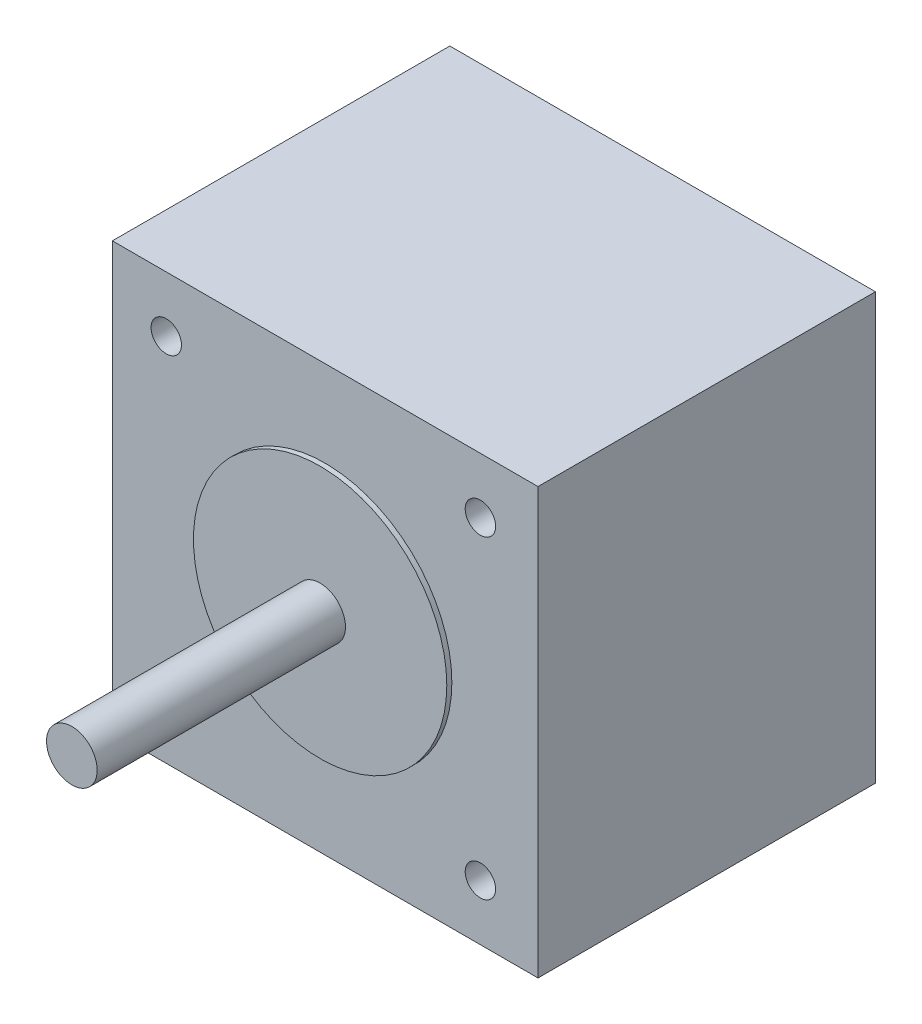
ISO-10303-21;
HEADER;
FILE_DESCRIPTION(('STEP AP214'),'2;1');
FILE_NAME('part.step','',(''),(''),'','','');
FILE_SCHEMA(('AUTOMOTIVE_DESIGN { 1 0 10303 214 1 1 1 1 }'));
ENDSEC;
DATA;
#1=APPLICATION_CONTEXT('core data for automotive mechanical design processes');
#2=APPLICATION_PROTOCOL_DEFINITION('international standard','automotive_design',2000,#1);
#3=PRODUCT_CONTEXT('',#1,'mechanical');
#4=PRODUCT('Part','Part','',(#3));
#5=PRODUCT_RELATED_PRODUCT_CATEGORY('part','',(#4));
#6=PRODUCT_DEFINITION_FORMATION('','',#4);
#7=PRODUCT_DEFINITION_CONTEXT('part definition',#1,'design');
#8=PRODUCT_DEFINITION('design','',#6,#7);
#9=PRODUCT_DEFINITION_SHAPE('','',#8);
#10=(LENGTH_UNIT() NAMED_UNIT(*) SI_UNIT(.MILLI.,.METRE.));
#11=(NAMED_UNIT(*) PLANE_ANGLE_UNIT() SI_UNIT($,.RADIAN.));
#12=(NAMED_UNIT(*) SI_UNIT($,.STERADIAN.) SOLID_ANGLE_UNIT());
#13=UNCERTAINTY_MEASURE_WITH_UNIT(LENGTH_MEASURE(1.E-05),#10,'distance_accuracy_value','');
#14=(GEOMETRIC_REPRESENTATION_CONTEXT(3) GLOBAL_UNCERTAINTY_ASSIGNED_CONTEXT((#13)) GLOBAL_UNIT_ASSIGNED_CONTEXT((#10,
#11,#12)) REPRESENTATION_CONTEXT('',''));
#15=CARTESIAN_POINT('',(0.,0.,0.));
#16=DIRECTION('',(0.,0.,1.));
#17=DIRECTION('',(1.,0.,0.));
#18=AXIS2_PLACEMENT_3D('',#15,#16,#17);
#19=CARTESIAN_POINT('',(-21.,-21.,33.3));
#20=DIRECTION('',(1.,0.,0.));
#21=DIRECTION('',(0.,0.,-1.));
#22=AXIS2_PLACEMENT_3D('',#19,#20,#21);
#23=PLANE('',#22);
#24=DIRECTION('',(0.,-1.,0.));
#25=VECTOR('',#24,1.);
#26=CARTESIAN_POINT('',(-21.,-21.,0.));
#27=LINE('',#26,#25);
#28=CARTESIAN_POINT('',(-21.,21.,0.));
#29=VERTEX_POINT('',#28);
#30=CARTESIAN_POINT('',(-21.,-21.,0.));
#31=VERTEX_POINT('',#30);
#32=EDGE_CURVE('E100',#29,#31,#27,.T.);
#33=ORIENTED_EDGE('',*,*,#32,.T.);
#34=DIRECTION('',(0.,0.,-1.));
#35=VECTOR('',#34,1.);
#36=CARTESIAN_POINT('',(-21.,-21.,33.3));
#37=LINE('',#36,#35);
#38=CARTESIAN_POINT('',(-21.,-21.,33.3));
#39=VERTEX_POINT('',#38);
#40=EDGE_CURVE('E11',#39,#31,#37,.T.);
#41=ORIENTED_EDGE('',*,*,#40,.F.);
#42=DIRECTION('',(0.,-1.,0.));
#43=VECTOR('',#42,1.);
#44=CARTESIAN_POINT('',(-21.,-21.,33.3));
#45=LINE('',#44,#43);
#46=CARTESIAN_POINT('',(-21.,21.,33.3));
#47=VERTEX_POINT('',#46);
#48=EDGE_CURVE('E87',#47,#39,#45,.T.);
#49=ORIENTED_EDGE('',*,*,#48,.F.);
#50=DIRECTION('',(0.,0.,-1.));
#51=VECTOR('',#50,1.);
#52=CARTESIAN_POINT('',(-21.,21.,33.3));
#53=LINE('',#52,#51);
#54=EDGE_CURVE('E96',#47,#29,#53,.T.);
#55=ORIENTED_EDGE('',*,*,#54,.T.);
#56=EDGE_LOOP('',(#33,#41,#49,#55));
#57=FACE_BOUND('',#56,.T.);
#58=ADVANCED_FACE('F35',(#57),#23,.F.);
#59=CARTESIAN_POINT('',(21.,-21.,33.3));
#60=DIRECTION('',(0.,1.,0.));
#61=DIRECTION('',(-1.,0.,0.));
#62=AXIS2_PLACEMENT_3D('',#59,#60,#61);
#63=PLANE('',#62);
#64=DIRECTION('',(1.,0.,0.));
#65=VECTOR('',#64,1.);
#66=CARTESIAN_POINT('',(21.,-21.,0.));
#67=LINE('',#66,#65);
#68=CARTESIAN_POINT('',(21.,-21.,0.));
#69=VERTEX_POINT('',#68);
#70=EDGE_CURVE('E91',#31,#69,#67,.T.);
#71=ORIENTED_EDGE('',*,*,#70,.T.);
#72=DIRECTION('',(0.,0.,-1.));
#73=VECTOR('',#72,1.);
#74=CARTESIAN_POINT('',(21.,-21.,33.3));
#75=LINE('',#74,#73);
#76=CARTESIAN_POINT('',(21.,-21.,33.3));
#77=VERTEX_POINT('',#76);
#78=EDGE_CURVE('E44',#77,#69,#75,.T.);
#79=ORIENTED_EDGE('',*,*,#78,.F.);
#80=DIRECTION('',(1.,0.,0.));
#81=VECTOR('',#80,1.);
#82=CARTESIAN_POINT('',(21.,-21.,33.3));
#83=LINE('',#82,#81);
#84=EDGE_CURVE('E82',#39,#77,#83,.T.);
#85=ORIENTED_EDGE('',*,*,#84,.F.);
#86=ORIENTED_EDGE('',*,*,#40,.T.);
#87=EDGE_LOOP('',(#71,#79,#85,#86));
#88=FACE_BOUND('',#87,.T.);
#89=ADVANCED_FACE('F90',(#88),#63,.F.);
#90=CARTESIAN_POINT('',(21.,-21.,33.3));
#91=DIRECTION('',(-1.,0.,0.));
#92=DIRECTION('',(0.,0.,1.));
#93=AXIS2_PLACEMENT_3D('',#90,#91,#92);
#94=PLANE('',#93);
#95=DIRECTION('',(0.,1.,0.));
#96=VECTOR('',#95,1.);
#97=CARTESIAN_POINT('',(21.,-21.,0.));
#98=LINE('',#97,#96);
#99=CARTESIAN_POINT('',(21.,21.,0.));
#100=VERTEX_POINT('',#99);
#101=EDGE_CURVE('E69',#69,#100,#98,.T.);
#102=ORIENTED_EDGE('',*,*,#101,.T.);
#103=DIRECTION('',(0.,0.,-1.));
#104=VECTOR('',#103,1.);
#105=CARTESIAN_POINT('',(21.,21.,33.3));
#106=LINE('',#105,#104);
#107=CARTESIAN_POINT('',(21.,21.,33.3));
#108=VERTEX_POINT('',#107);
#109=EDGE_CURVE('E92',#108,#100,#106,.T.);
#110=ORIENTED_EDGE('',*,*,#109,.F.);
#111=DIRECTION('',(0.,1.,0.));
#112=VECTOR('',#111,1.);
#113=CARTESIAN_POINT('',(21.,-21.,33.3));
#114=LINE('',#113,#112);
#115=EDGE_CURVE('E85',#77,#108,#114,.T.);
#116=ORIENTED_EDGE('',*,*,#115,.F.);
#117=ORIENTED_EDGE('',*,*,#78,.T.);
#118=EDGE_LOOP('',(#102,#110,#116,#117));
#119=FACE_BOUND('',#118,.T.);
#120=ADVANCED_FACE('F94',(#119),#94,.F.);
#121=CARTESIAN_POINT('',(21.,21.,33.3));
#122=DIRECTION('',(0.,-1.,0.));
#123=DIRECTION('',(1.,0.,0.));
#124=AXIS2_PLACEMENT_3D('',#121,#122,#123);
#125=PLANE('',#124);
#126=DIRECTION('',(-1.,0.,0.));
#127=VECTOR('',#126,1.);
#128=CARTESIAN_POINT('',(21.,21.,0.));
#129=LINE('',#128,#127);
#130=EDGE_CURVE('E75',#100,#29,#129,.T.);
#131=ORIENTED_EDGE('',*,*,#130,.T.);
#132=ORIENTED_EDGE('',*,*,#54,.F.);
#133=DIRECTION('',(-1.,0.,0.));
#134=VECTOR('',#133,1.);
#135=CARTESIAN_POINT('',(21.,21.,33.3));
#136=LINE('',#135,#134);
#137=EDGE_CURVE('E52',#108,#47,#136,.T.);
#138=ORIENTED_EDGE('',*,*,#137,.F.);
#139=ORIENTED_EDGE('',*,*,#109,.T.);
#140=EDGE_LOOP('',(#131,#132,#138,#139));
#141=FACE_BOUND('',#140,.T.);
#142=ADVANCED_FACE('F108',(#141),#125,.F.);
#143=CARTESIAN_POINT('',(0.,0.,33.3));
#144=DIRECTION('',(0.,0.,1.));
#145=DIRECTION('',(1.,0.,0.));
#146=AXIS2_PLACEMENT_3D('',#143,#144,#145);
#147=PLANE('',#146);
#148=CARTESIAN_POINT('',(15.3174614589269,15.5,33.3));
#149=DIRECTION('',(0.,0.,1.));
#150=DIRECTION('',(1.,0.,0.));
#151=AXIS2_PLACEMENT_3D('',#148,#149,#150);
#152=CIRCLE('',#151,1.5);
#153=CARTESIAN_POINT('',(16.8174614589269,15.5,33.3));
#154=VERTEX_POINT('',#153);
#155=EDGE_CURVE('E138',#154,#154,#152,.T.);
#156=ORIENTED_EDGE('',*,*,#155,.F.);
#157=EDGE_LOOP('',(#156));
#158=FACE_BOUND('',#157,.T.);
#159=CARTESIAN_POINT('',(-15.6825385410731,-15.5,33.3));
#160=DIRECTION('',(0.,0.,1.));
#161=DIRECTION('',(1.,0.,0.));
#162=AXIS2_PLACEMENT_3D('',#159,#160,#161);
#163=CIRCLE('',#162,1.5);
#164=CARTESIAN_POINT('',(-14.1825385410731,-15.5,33.3));
#165=VERTEX_POINT('',#164);
#166=EDGE_CURVE('E132',#165,#165,#163,.T.);
#167=ORIENTED_EDGE('',*,*,#166,.F.);
#168=EDGE_LOOP('',(#167));
#169=FACE_BOUND('',#168,.T.);
#170=CARTESIAN_POINT('',(15.3174614589269,-15.5,33.3));
#171=DIRECTION('',(0.,0.,1.));
#172=DIRECTION('',(1.,0.,0.));
#173=AXIS2_PLACEMENT_3D('',#170,#171,#172);
#174=CIRCLE('',#173,1.5);
#175=CARTESIAN_POINT('',(16.8174614589269,-15.5,33.3));
#176=VERTEX_POINT('',#175);
#177=EDGE_CURVE('E126',#176,#176,#174,.T.);
#178=ORIENTED_EDGE('',*,*,#177,.F.);
#179=EDGE_LOOP('',(#178));
#180=FACE_BOUND('',#179,.T.);
#181=CARTESIAN_POINT('',(-15.6825385410731,15.5,33.3));
#182=DIRECTION('',(0.,0.,1.));
#183=DIRECTION('',(1.,0.,0.));
#184=AXIS2_PLACEMENT_3D('',#181,#182,#183);
#185=CIRCLE('',#184,1.5);
#186=CARTESIAN_POINT('',(-14.1825385410731,15.5,33.3));
#187=VERTEX_POINT('',#186);
#188=EDGE_CURVE('E120',#187,#187,#185,.T.);
#189=ORIENTED_EDGE('',*,*,#188,.F.);
#190=EDGE_LOOP('',(#189));
#191=FACE_BOUND('',#190,.T.);
#192=CARTESIAN_POINT('',(0.,0.,33.3));
#193=DIRECTION('',(0.,0.,1.));
#194=DIRECTION('',(1.,0.,0.));
#195=AXIS2_PLACEMENT_3D('',#192,#193,#194);
#196=CIRCLE('',#195,12.5);
#197=CARTESIAN_POINT('',(12.5,0.,33.3));
#198=VERTEX_POINT('',#197);
#199=EDGE_CURVE('E114',#198,#198,#196,.T.);
#200=ORIENTED_EDGE('',*,*,#199,.F.);
#201=EDGE_LOOP('',(#200));
#202=FACE_BOUND('',#201,.T.);
#203=ORIENTED_EDGE('',*,*,#48,.T.);
#204=ORIENTED_EDGE('',*,*,#84,.T.);
#205=ORIENTED_EDGE('',*,*,#115,.T.);
#206=ORIENTED_EDGE('',*,*,#137,.T.);
#207=EDGE_LOOP('',(#203,#204,#205,#206));
#208=FACE_BOUND('',#207,.T.);
#209=ADVANCED_FACE('F83',(#158,#169,#180,#191,#202,#208),#147,.T.);
#210=CARTESIAN_POINT('',(0.,0.,0.));
#211=DIRECTION('',(0.,0.,1.));
#212=DIRECTION('',(1.,0.,0.));
#213=AXIS2_PLACEMENT_3D('',#210,#211,#212);
#214=PLANE('',#213);
#215=ORIENTED_EDGE('',*,*,#32,.F.);
#216=ORIENTED_EDGE('',*,*,#130,.F.);
#217=ORIENTED_EDGE('',*,*,#101,.F.);
#218=ORIENTED_EDGE('',*,*,#70,.F.);
#219=EDGE_LOOP('',(#215,#216,#217,#218));
#220=FACE_BOUND('',#219,.T.);
#221=ADVANCED_FACE('F111',(#220),#214,.F.);
#222=CARTESIAN_POINT('',(0.,0.,33.8));
#223=DIRECTION('',(0.,0.,-1.));
#224=DIRECTION('',(-1.,0.,0.));
#225=AXIS2_PLACEMENT_3D('',#222,#223,#224);
#226=CYLINDRICAL_SURFACE('',#225,12.5);
#227=CARTESIAN_POINT('',(0.,0.,33.8));
#228=DIRECTION('',(0.,0.,1.));
#229=DIRECTION('',(1.,0.,0.));
#230=AXIS2_PLACEMENT_3D('',#227,#228,#229);
#231=CIRCLE('',#230,12.5);
#232=CARTESIAN_POINT('',(12.5,0.,33.8));
#233=VERTEX_POINT('',#232);
#234=EDGE_CURVE('E103',#233,#233,#231,.T.);
#235=ORIENTED_EDGE('',*,*,#234,.F.);
#236=EDGE_LOOP('',(#235));
#237=FACE_BOUND('',#236,.T.);
#238=ORIENTED_EDGE('',*,*,#199,.T.);
#239=EDGE_LOOP('',(#238));
#240=FACE_BOUND('',#239,.T.);
#241=ADVANCED_FACE('F180',(#237,#240),#226,.T.);
#242=CARTESIAN_POINT('',(0.,0.,33.8));
#243=DIRECTION('',(0.,0.,1.));
#244=DIRECTION('',(1.,0.,0.));
#245=AXIS2_PLACEMENT_3D('',#242,#243,#244);
#246=PLANE('',#245);
#247=CARTESIAN_POINT('',(0.,0.,33.8));
#248=DIRECTION('',(0.,0.,1.));
#249=DIRECTION('',(1.,0.,0.));
#250=AXIS2_PLACEMENT_3D('',#247,#248,#249);
#251=CIRCLE('',#250,2.5);
#252=CARTESIAN_POINT('',(2.5,0.,33.8));
#253=VERTEX_POINT('',#252);
#254=EDGE_CURVE('E38',#253,#253,#251,.F.);
#255=ORIENTED_EDGE('',*,*,#254,.T.);
#256=EDGE_LOOP('',(#255));
#257=FACE_BOUND('',#256,.T.);
#258=ORIENTED_EDGE('',*,*,#234,.T.);
#259=EDGE_LOOP('',(#258));
#260=FACE_BOUND('',#259,.T.);
#261=ADVANCED_FACE('F150',(#257,#260),#246,.T.);
#262=CARTESIAN_POINT('',(-15.6825385410731,15.5,23.3));
#263=DIRECTION('',(0.,0.,1.));
#264=DIRECTION('',(1.,0.,0.));
#265=AXIS2_PLACEMENT_3D('',#262,#263,#264);
#266=CYLINDRICAL_SURFACE('',#265,1.5);
#267=CARTESIAN_POINT('',(-15.6825385410731,15.5,23.3));
#268=DIRECTION('',(0.,0.,1.));
#269=DIRECTION('',(1.,0.,0.));
#270=AXIS2_PLACEMENT_3D('',#267,#268,#269);
#271=CIRCLE('',#270,1.5);
#272=CARTESIAN_POINT('',(-14.1825385410731,15.5,23.3));
#273=VERTEX_POINT('',#272);
#274=EDGE_CURVE('E117',#273,#273,#271,.T.);
#275=ORIENTED_EDGE('',*,*,#274,.F.);
#276=EDGE_LOOP('',(#275));
#277=FACE_BOUND('',#276,.T.);
#278=ORIENTED_EDGE('',*,*,#188,.T.);
#279=EDGE_LOOP('',(#278));
#280=FACE_BOUND('',#279,.T.);
#281=ADVANCED_FACE('F189',(#277,#280),#266,.F.);
#282=CARTESIAN_POINT('',(-15.6825385410731,15.5,23.3));
#283=DIRECTION('',(0.,0.,1.));
#284=DIRECTION('',(1.,0.,0.));
#285=AXIS2_PLACEMENT_3D('',#282,#283,#284);
#286=PLANE('',#285);
#287=ORIENTED_EDGE('',*,*,#274,.T.);
#288=EDGE_LOOP('',(#287));
#289=FACE_BOUND('',#288,.T.);
#290=ADVANCED_FACE('F192',(#289),#286,.T.);
#291=CARTESIAN_POINT('',(15.3174614589269,-15.5,23.3));
#292=DIRECTION('',(0.,0.,1.));
#293=DIRECTION('',(1.,0.,0.));
#294=AXIS2_PLACEMENT_3D('',#291,#292,#293);
#295=CYLINDRICAL_SURFACE('',#294,1.5);
#296=CARTESIAN_POINT('',(15.3174614589269,-15.5,23.3));
#297=DIRECTION('',(0.,0.,1.));
#298=DIRECTION('',(1.,0.,0.));
#299=AXIS2_PLACEMENT_3D('',#296,#297,#298);
#300=CIRCLE('',#299,1.5);
#301=CARTESIAN_POINT('',(16.8174614589269,-15.5,23.3));
#302=VERTEX_POINT('',#301);
#303=EDGE_CURVE('E123',#302,#302,#300,.T.);
#304=ORIENTED_EDGE('',*,*,#303,.F.);
#305=EDGE_LOOP('',(#304));
#306=FACE_BOUND('',#305,.T.);
#307=ORIENTED_EDGE('',*,*,#177,.T.);
#308=EDGE_LOOP('',(#307));
#309=FACE_BOUND('',#308,.T.);
#310=ADVANCED_FACE('F196',(#306,#309),#295,.F.);
#311=CARTESIAN_POINT('',(15.3174614589269,-15.5,23.3));
#312=DIRECTION('',(0.,0.,1.));
#313=DIRECTION('',(1.,0.,0.));
#314=AXIS2_PLACEMENT_3D('',#311,#312,#313);
#315=PLANE('',#314);
#316=ORIENTED_EDGE('',*,*,#303,.T.);
#317=EDGE_LOOP('',(#316));
#318=FACE_BOUND('',#317,.T.);
#319=ADVANCED_FACE('F200',(#318),#315,.T.);
#320=CARTESIAN_POINT('',(-15.6825385410731,-15.5,23.3));
#321=DIRECTION('',(0.,0.,1.));
#322=DIRECTION('',(1.,0.,0.));
#323=AXIS2_PLACEMENT_3D('',#320,#321,#322);
#324=CYLINDRICAL_SURFACE('',#323,1.5);
#325=CARTESIAN_POINT('',(-15.6825385410731,-15.5,23.3));
#326=DIRECTION('',(0.,0.,1.));
#327=DIRECTION('',(1.,0.,0.));
#328=AXIS2_PLACEMENT_3D('',#325,#326,#327);
#329=CIRCLE('',#328,1.5);
#330=CARTESIAN_POINT('',(-14.1825385410731,-15.5,23.3));
#331=VERTEX_POINT('',#330);
#332=EDGE_CURVE('E129',#331,#331,#329,.T.);
#333=ORIENTED_EDGE('',*,*,#332,.F.);
#334=EDGE_LOOP('',(#333));
#335=FACE_BOUND('',#334,.T.);
#336=ORIENTED_EDGE('',*,*,#166,.T.);
#337=EDGE_LOOP('',(#336));
#338=FACE_BOUND('',#337,.T.);
#339=ADVANCED_FACE('F204',(#335,#338),#324,.F.);
#340=CARTESIAN_POINT('',(-15.6825385410731,-15.5,23.3));
#341=DIRECTION('',(0.,0.,1.));
#342=DIRECTION('',(1.,0.,0.));
#343=AXIS2_PLACEMENT_3D('',#340,#341,#342);
#344=PLANE('',#343);
#345=ORIENTED_EDGE('',*,*,#332,.T.);
#346=EDGE_LOOP('',(#345));
#347=FACE_BOUND('',#346,.T.);
#348=ADVANCED_FACE('F208',(#347),#344,.T.);
#349=CARTESIAN_POINT('',(15.3174614589269,15.5,23.3));
#350=DIRECTION('',(0.,0.,1.));
#351=DIRECTION('',(1.,0.,0.));
#352=AXIS2_PLACEMENT_3D('',#349,#350,#351);
#353=CYLINDRICAL_SURFACE('',#352,1.5);
#354=CARTESIAN_POINT('',(15.3174614589269,15.5,23.3));
#355=DIRECTION('',(0.,0.,1.));
#356=DIRECTION('',(1.,0.,0.));
#357=AXIS2_PLACEMENT_3D('',#354,#355,#356);
#358=CIRCLE('',#357,1.5);
#359=CARTESIAN_POINT('',(16.8174614589269,15.5,23.3));
#360=VERTEX_POINT('',#359);
#361=EDGE_CURVE('E135',#360,#360,#358,.T.);
#362=ORIENTED_EDGE('',*,*,#361,.F.);
#363=EDGE_LOOP('',(#362));
#364=FACE_BOUND('',#363,.T.);
#365=ORIENTED_EDGE('',*,*,#155,.T.);
#366=EDGE_LOOP('',(#365));
#367=FACE_BOUND('',#366,.T.);
#368=ADVANCED_FACE('F164',(#364,#367),#353,.F.);
#369=CARTESIAN_POINT('',(15.3174614589269,15.5,23.3));
#370=DIRECTION('',(0.,0.,1.));
#371=DIRECTION('',(1.,0.,0.));
#372=AXIS2_PLACEMENT_3D('',#369,#370,#371);
#373=PLANE('',#372);
#374=ORIENTED_EDGE('',*,*,#361,.T.);
#375=EDGE_LOOP('',(#374));
#376=FACE_BOUND('',#375,.T.);
#377=ADVANCED_FACE('F157',(#376),#373,.T.);
#378=CARTESIAN_POINT('',(0.,0.,58.3));
#379=DIRECTION('',(0.,0.,-1.));
#380=DIRECTION('',(-1.,0.,0.));
#381=AXIS2_PLACEMENT_3D('',#378,#379,#380);
#382=CYLINDRICAL_SURFACE('',#381,2.5);
#383=ORIENTED_EDGE('',*,*,#254,.F.);
#384=EDGE_LOOP('',(#383));
#385=FACE_BOUND('',#384,.T.);
#386=CARTESIAN_POINT('',(0.,0.,58.3));
#387=DIRECTION('',(0.,0.,1.));
#388=DIRECTION('',(1.,0.,0.));
#389=AXIS2_PLACEMENT_3D('',#386,#387,#388);
#390=CIRCLE('',#389,2.5);
#391=CARTESIAN_POINT('',(2.5,0.,58.3));
#392=VERTEX_POINT('',#391);
#393=EDGE_CURVE('E143',#392,#392,#390,.T.);
#394=ORIENTED_EDGE('',*,*,#393,.F.);
#395=EDGE_LOOP('',(#394));
#396=FACE_BOUND('',#395,.T.);
#397=ADVANCED_FACE('F153',(#385,#396),#382,.T.);
#398=CARTESIAN_POINT('',(0.,0.,58.3));
#399=DIRECTION('',(0.,0.,1.));
#400=DIRECTION('',(1.,0.,0.));
#401=AXIS2_PLACEMENT_3D('',#398,#399,#400);
#402=PLANE('',#401);
#403=ORIENTED_EDGE('',*,*,#393,.T.);
#404=EDGE_LOOP('',(#403));
#405=FACE_BOUND('',#404,.T.);
#406=ADVANCED_FACE('F156',(#405),#402,.T.);
#407=CLOSED_SHELL('',(#58,#89,#120,#142,#209,#221,#241,#261,#281,#290,#310,#319,#339,#348,#368,
#377,#397,#406));
#408=MANIFOLD_SOLID_BREP('B2',#407);
#409=ADVANCED_BREP_SHAPE_REPRESENTATION('',(#18,#408),#14);
#410=SHAPE_DEFINITION_REPRESENTATION(#9,#409);
ENDSEC;
END-ISO-10303-21;
